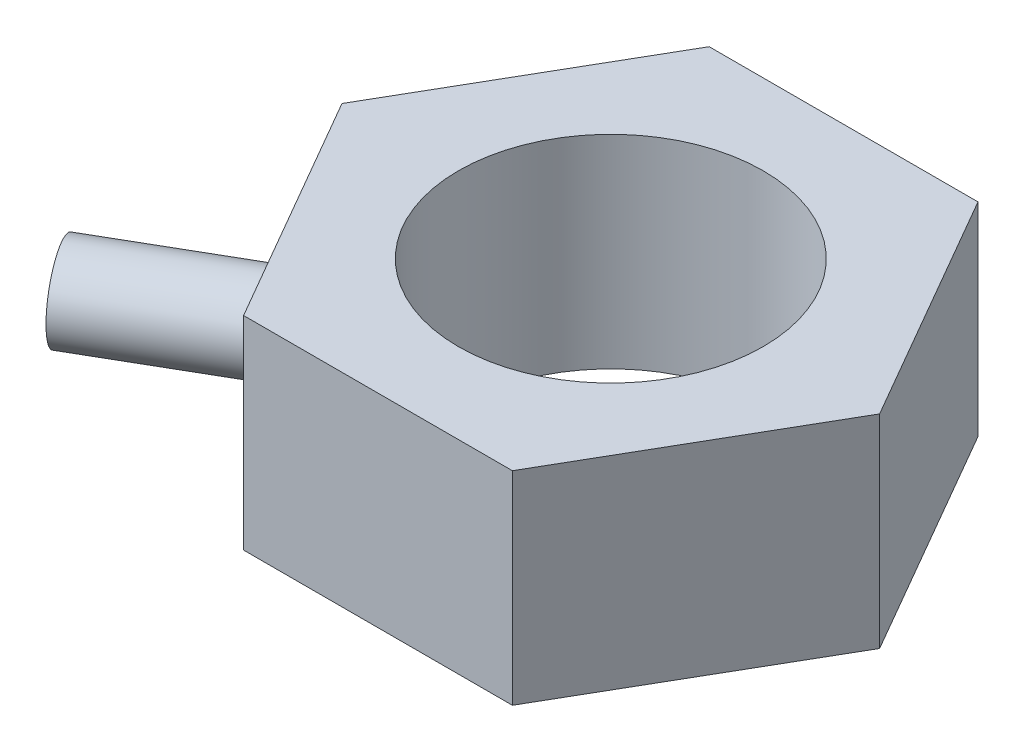
ISO-10303-21;
HEADER;
FILE_DESCRIPTION(('STEP AP214'),'2;1');
FILE_NAME('part.step','',(''),(''),'','','');
FILE_SCHEMA(('AUTOMOTIVE_DESIGN { 1 0 10303 214 1 1 1 1 }'));
ENDSEC;
DATA;
#1=APPLICATION_CONTEXT('core data for automotive mechanical design processes');
#2=APPLICATION_PROTOCOL_DEFINITION('international standard','automotive_design',2000,#1);
#3=PRODUCT_CONTEXT('',#1,'mechanical');
#4=PRODUCT('Part','Part','',(#3));
#5=PRODUCT_RELATED_PRODUCT_CATEGORY('part','',(#4));
#6=PRODUCT_DEFINITION_FORMATION('','',#4);
#7=PRODUCT_DEFINITION_CONTEXT('part definition',#1,'design');
#8=PRODUCT_DEFINITION('design','',#6,#7);
#9=PRODUCT_DEFINITION_SHAPE('','',#8);
#10=(LENGTH_UNIT() NAMED_UNIT(*) SI_UNIT(.MILLI.,.METRE.));
#11=(NAMED_UNIT(*) PLANE_ANGLE_UNIT() SI_UNIT($,.RADIAN.));
#12=(NAMED_UNIT(*) SI_UNIT($,.STERADIAN.) SOLID_ANGLE_UNIT());
#13=UNCERTAINTY_MEASURE_WITH_UNIT(LENGTH_MEASURE(1.E-05),#10,'distance_accuracy_value','');
#14=(GEOMETRIC_REPRESENTATION_CONTEXT(3) GLOBAL_UNCERTAINTY_ASSIGNED_CONTEXT((#13)) GLOBAL_UNIT_ASSIGNED_CONTEXT((#10,
#11,#12)) REPRESENTATION_CONTEXT('',''));
#15=CARTESIAN_POINT('',(0.,0.,0.));
#16=DIRECTION('',(0.,0.,1.));
#17=DIRECTION('',(1.,0.,0.));
#18=AXIS2_PLACEMENT_3D('',#15,#16,#17);
#19=CARTESIAN_POINT('',(-2.45405788986387,-6.59314032413643,6.03046084599262));
#20=DIRECTION('',(-0.866025403784438,0.,0.500000000000001));
#21=DIRECTION('',(0.500000000000001,0.,0.866025403784438));
#22=AXIS2_PLACEMENT_3D('',#19,#20,#21);
#23=PLANE('',#22);
#24=DIRECTION('',(-0.500000000000001,0.,-0.866025403784438));
#25=VECTOR('',#24,1.);
#26=CARTESIAN_POINT('',(-2.45405788986387,-8.99314032413643,6.03046084599262));
#27=LINE('',#26,#25);
#28=CARTESIAN_POINT('',(-2.45405788986387,-8.99314032413643,6.03046084599262));
#29=VERTEX_POINT('',#28);
#30=CARTESIAN_POINT('',(-4.04177113013535,-8.99314032413643,3.28046084599261));
#31=VERTEX_POINT('',#30);
#32=EDGE_CURVE('E118',#29,#31,#27,.T.);
#33=ORIENTED_EDGE('',*,*,#32,.T.);
#34=DIRECTION('',(0.,-1.,0.));
#35=VECTOR('',#34,1.);
#36=CARTESIAN_POINT('',(-4.04177113013535,-6.59314032413643,3.28046084599261));
#37=LINE('',#36,#35);
#38=CARTESIAN_POINT('',(-4.04177113013535,-6.59314032413643,3.28046084599261));
#39=VERTEX_POINT('',#38);
#40=EDGE_CURVE('E41',#39,#31,#37,.T.);
#41=ORIENTED_EDGE('',*,*,#40,.F.);
#42=DIRECTION('',(-0.500000000000001,0.,-0.866025403784438));
#43=VECTOR('',#42,1.);
#44=CARTESIAN_POINT('',(-2.45405788986387,-6.59314032413643,6.03046084599262));
#45=LINE('',#44,#43);
#46=CARTESIAN_POINT('',(-2.45405788986387,-6.59314032413643,6.03046084599262));
#47=VERTEX_POINT('',#46);
#48=EDGE_CURVE('E129',#47,#39,#45,.T.);
#49=ORIENTED_EDGE('',*,*,#48,.F.);
#50=DIRECTION('',(0.,-1.,0.));
#51=VECTOR('',#50,1.);
#52=CARTESIAN_POINT('',(-2.45405788986387,-6.59314032413643,6.03046084599262));
#53=LINE('',#52,#51);
#54=EDGE_CURVE('E114',#47,#29,#53,.T.);
#55=ORIENTED_EDGE('',*,*,#54,.T.);
#56=EDGE_LOOP('',(#33,#41,#49,#55));
#57=FACE_BOUND('',#56,.T.);
#58=ADVANCED_FACE('F33',(#57),#23,.F.);
#59=CARTESIAN_POINT('',(-4.04177113013535,-6.59314032413643,3.28046084599261));
#60=DIRECTION('',(0.,0.,1.));
#61=DIRECTION('',(1.,0.,0.));
#62=AXIS2_PLACEMENT_3D('',#59,#60,#61);
#63=PLANE('',#62);
#64=DIRECTION('',(-1.,0.,0.));
#65=VECTOR('',#64,1.);
#66=CARTESIAN_POINT('',(-4.04177113013535,-8.99314032413643,3.28046084599261));
#67=LINE('',#66,#65);
#68=CARTESIAN_POINT('',(-7.21719761067831,-8.99314032413643,3.28046084599262));
#69=VERTEX_POINT('',#68);
#70=EDGE_CURVE('E121',#31,#69,#67,.T.);
#71=ORIENTED_EDGE('',*,*,#70,.T.);
#72=DIRECTION('',(0.,-1.,0.));
#73=VECTOR('',#72,1.);
#74=CARTESIAN_POINT('',(-7.21719761067831,-6.59314032413643,3.28046084599262));
#75=LINE('',#74,#73);
#76=CARTESIAN_POINT('',(-7.21719761067831,-6.59314032413643,3.28046084599262));
#77=VERTEX_POINT('',#76);
#78=EDGE_CURVE('E133',#77,#69,#75,.T.);
#79=ORIENTED_EDGE('',*,*,#78,.F.);
#80=DIRECTION('',(-1.,0.,0.));
#81=VECTOR('',#80,1.);
#82=CARTESIAN_POINT('',(-4.04177113013535,-6.59314032413643,3.28046084599261));
#83=LINE('',#82,#81);
#84=EDGE_CURVE('E87',#39,#77,#83,.T.);
#85=ORIENTED_EDGE('',*,*,#84,.F.);
#86=ORIENTED_EDGE('',*,*,#40,.T.);
#87=EDGE_LOOP('',(#71,#79,#85,#86));
#88=FACE_BOUND('',#87,.T.);
#89=ADVANCED_FACE('F151',(#88),#63,.F.);
#90=CARTESIAN_POINT('',(-7.21719761067831,-6.59314032413643,3.28046084599262));
#91=DIRECTION('',(0.866025403784441,0.,0.499999999999995));
#92=DIRECTION('',(0.499999999999995,0.,-0.866025403784442));
#93=AXIS2_PLACEMENT_3D('',#90,#91,#92);
#94=PLANE('',#93);
#95=DIRECTION('',(-0.499999999999995,0.,0.866025403784442));
#96=VECTOR('',#95,1.);
#97=CARTESIAN_POINT('',(-7.21719761067831,-8.99314032413643,3.28046084599262));
#98=LINE('',#97,#96);
#99=CARTESIAN_POINT('',(-8.80491085094977,-8.99314032413643,6.03046084599265));
#100=VERTEX_POINT('',#99);
#101=EDGE_CURVE('E124',#69,#100,#98,.T.);
#102=ORIENTED_EDGE('',*,*,#101,.T.);
#103=DIRECTION('',(0.,-1.,0.));
#104=VECTOR('',#103,1.);
#105=CARTESIAN_POINT('',(-8.80491085094977,-6.59314032413643,6.03046084599265));
#106=LINE('',#105,#104);
#107=CARTESIAN_POINT('',(-8.80491085094977,-6.59314032413643,6.03046084599265));
#108=VERTEX_POINT('',#107);
#109=EDGE_CURVE('E109',#108,#100,#106,.T.);
#110=ORIENTED_EDGE('',*,*,#109,.F.);
#111=DIRECTION('',(-0.499999999999995,0.,0.866025403784442));
#112=VECTOR('',#111,1.);
#113=CARTESIAN_POINT('',(-7.21719761067831,-6.59314032413643,3.28046084599262));
#114=LINE('',#113,#112);
#115=EDGE_CURVE('E100',#77,#108,#114,.T.);
#116=ORIENTED_EDGE('',*,*,#115,.F.);
#117=ORIENTED_EDGE('',*,*,#78,.T.);
#118=EDGE_LOOP('',(#102,#110,#116,#117));
#119=FACE_BOUND('',#118,.T.);
#120=ADVANCED_FACE('F154',(#119),#94,.F.);
#121=CARTESIAN_POINT('',(-8.80491085094977,-6.59314032413643,6.03046084599265));
#122=DIRECTION('',(0.866025403784434,0.,-0.500000000000007));
#123=DIRECTION('',(-0.500000000000007,0.,-0.866025403784435));
#124=AXIS2_PLACEMENT_3D('',#121,#122,#123);
#125=PLANE('',#124);
#126=CARTESIAN_POINT('',(-8.01105423081402,-7.79314032413643,7.40546084599264));
#127=DIRECTION('',(0.866025403784434,0.,-0.500000000000007));
#128=DIRECTION('',(-0.500000000000007,0.,-0.866025403784435));
#129=AXIS2_PLACEMENT_3D('',#126,#127,#128);
#130=CIRCLE('',#129,0.5);
#131=CARTESIAN_POINT('',(-8.26105423081403,-7.79314032413643,6.97244814410043));
#132=VERTEX_POINT('',#131);
#133=EDGE_CURVE('E11',#132,#132,#130,.F.);
#134=ORIENTED_EDGE('',*,*,#133,.F.);
#135=EDGE_LOOP('',(#134));
#136=FACE_BOUND('',#135,.T.);
#137=DIRECTION('',(0.500000000000007,0.,0.866025403784435));
#138=VECTOR('',#137,1.);
#139=CARTESIAN_POINT('',(-8.80491085094977,-8.99314032413643,6.03046084599265));
#140=LINE('',#139,#138);
#141=CARTESIAN_POINT('',(-7.21719761067827,-8.99314032413643,8.78046084599265));
#142=VERTEX_POINT('',#141);
#143=EDGE_CURVE('E108',#100,#142,#140,.T.);
#144=ORIENTED_EDGE('',*,*,#143,.T.);
#145=DIRECTION('',(0.,-1.,0.));
#146=VECTOR('',#145,1.);
#147=CARTESIAN_POINT('',(-7.21719761067827,-6.59314032413643,8.78046084599265));
#148=LINE('',#147,#146);
#149=CARTESIAN_POINT('',(-7.21719761067827,-6.59314032413643,8.78046084599265));
#150=VERTEX_POINT('',#149);
#151=EDGE_CURVE('E105',#150,#142,#148,.T.);
#152=ORIENTED_EDGE('',*,*,#151,.F.);
#153=DIRECTION('',(0.500000000000007,0.,0.866025403784435));
#154=VECTOR('',#153,1.);
#155=CARTESIAN_POINT('',(-8.80491085094977,-6.59314032413643,6.03046084599265));
#156=LINE('',#155,#154);
#157=EDGE_CURVE('E94',#108,#150,#156,.T.);
#158=ORIENTED_EDGE('',*,*,#157,.F.);
#159=ORIENTED_EDGE('',*,*,#109,.T.);
#160=EDGE_LOOP('',(#144,#152,#158,#159));
#161=FACE_BOUND('',#160,.T.);
#162=ADVANCED_FACE('F106',(#136,#161),#125,.F.);
#163=CARTESIAN_POINT('',(-7.21719761067827,-6.59314032413643,8.78046084599265));
#164=DIRECTION('',(0.,0.,-1.));
#165=DIRECTION('',(-1.,0.,0.));
#166=AXIS2_PLACEMENT_3D('',#163,#164,#165);
#167=PLANE('',#166);
#168=DIRECTION('',(1.,0.,0.));
#169=VECTOR('',#168,1.);
#170=CARTESIAN_POINT('',(-7.21719761067827,-8.99314032413643,8.78046084599265));
#171=LINE('',#170,#169);
#172=CARTESIAN_POINT('',(-4.04177113013531,-8.99314032413643,8.78046084599261));
#173=VERTEX_POINT('',#172);
#174=EDGE_CURVE('E72',#142,#173,#171,.T.);
#175=ORIENTED_EDGE('',*,*,#174,.T.);
#176=DIRECTION('',(0.,-1.,0.));
#177=VECTOR('',#176,1.);
#178=CARTESIAN_POINT('',(-4.04177113013531,-6.59314032413643,8.78046084599261));
#179=LINE('',#178,#177);
#180=CARTESIAN_POINT('',(-4.04177113013531,-6.59314032413643,8.78046084599261));
#181=VERTEX_POINT('',#180);
#182=EDGE_CURVE('E110',#181,#173,#179,.T.);
#183=ORIENTED_EDGE('',*,*,#182,.F.);
#184=DIRECTION('',(1.,0.,0.));
#185=VECTOR('',#184,1.);
#186=CARTESIAN_POINT('',(-7.21719761067827,-6.59314032413643,8.78046084599265));
#187=LINE('',#186,#185);
#188=EDGE_CURVE('E98',#150,#181,#187,.T.);
#189=ORIENTED_EDGE('',*,*,#188,.F.);
#190=ORIENTED_EDGE('',*,*,#151,.T.);
#191=EDGE_LOOP('',(#175,#183,#189,#190));
#192=FACE_BOUND('',#191,.T.);
#193=ADVANCED_FACE('F112',(#192),#167,.F.);
#194=CARTESIAN_POINT('',(-4.04177113013531,-6.59314032413643,8.78046084599261));
#195=DIRECTION('',(-0.866025403784441,0.,-0.499999999999995));
#196=DIRECTION('',(-0.499999999999995,0.,0.866025403784442));
#197=AXIS2_PLACEMENT_3D('',#194,#195,#196);
#198=PLANE('',#197);
#199=DIRECTION('',(0.499999999999995,0.,-0.866025403784442));
#200=VECTOR('',#199,1.);
#201=CARTESIAN_POINT('',(-4.04177113013531,-8.99314032413643,8.78046084599261));
#202=LINE('',#201,#200);
#203=EDGE_CURVE('E78',#173,#29,#202,.T.);
#204=ORIENTED_EDGE('',*,*,#203,.T.);
#205=ORIENTED_EDGE('',*,*,#54,.F.);
#206=DIRECTION('',(0.499999999999995,0.,-0.866025403784442));
#207=VECTOR('',#206,1.);
#208=CARTESIAN_POINT('',(-4.04177113013531,-6.59314032413643,8.78046084599261));
#209=LINE('',#208,#207);
#210=EDGE_CURVE('E49',#181,#47,#209,.T.);
#211=ORIENTED_EDGE('',*,*,#210,.F.);
#212=ORIENTED_EDGE('',*,*,#182,.T.);
#213=EDGE_LOOP('',(#204,#205,#211,#212));
#214=FACE_BOUND('',#213,.T.);
#215=ADVANCED_FACE('F159',(#214),#198,.F.);
#216=CARTESIAN_POINT('',(-5.62948437040682,-6.59314032413643,6.03046084599262));
#217=DIRECTION('',(0.,1.,0.));
#218=DIRECTION('',(0.,0.,1.));
#219=AXIS2_PLACEMENT_3D('',#216,#217,#218);
#220=PLANE('',#219);
#221=CARTESIAN_POINT('',(-5.62948437040682,-6.59314032413643,6.03046084599262));
#222=DIRECTION('',(0.,1.,0.));
#223=DIRECTION('',(0.,0.,1.));
#224=AXIS2_PLACEMENT_3D('',#221,#222,#223);
#225=CIRCLE('',#224,1.8);
#226=CARTESIAN_POINT('',(-5.62948437040682,-6.59314032413643,7.83046084599262));
#227=VERTEX_POINT('',#226);
#228=EDGE_CURVE('E122',#227,#227,#225,.T.);
#229=ORIENTED_EDGE('',*,*,#228,.F.);
#230=EDGE_LOOP('',(#229));
#231=FACE_BOUND('',#230,.T.);
#232=ORIENTED_EDGE('',*,*,#48,.T.);
#233=ORIENTED_EDGE('',*,*,#84,.T.);
#234=ORIENTED_EDGE('',*,*,#115,.T.);
#235=ORIENTED_EDGE('',*,*,#157,.T.);
#236=ORIENTED_EDGE('',*,*,#188,.T.);
#237=ORIENTED_EDGE('',*,*,#210,.T.);
#238=EDGE_LOOP('',(#232,#233,#234,#235,#236,#237));
#239=FACE_BOUND('',#238,.T.);
#240=ADVANCED_FACE('F96',(#231,#239),#220,.T.);
#241=CARTESIAN_POINT('',(-5.62948437040682,-8.99314032413643,6.03046084599262));
#242=DIRECTION('',(0.,1.,0.));
#243=DIRECTION('',(0.,0.,1.));
#244=AXIS2_PLACEMENT_3D('',#241,#242,#243);
#245=PLANE('',#244);
#246=CARTESIAN_POINT('',(-5.62948437040682,-8.99314032413643,6.03046084599262));
#247=DIRECTION('',(0.,1.,0.));
#248=DIRECTION('',(0.,0.,1.));
#249=AXIS2_PLACEMENT_3D('',#246,#247,#248);
#250=CIRCLE('',#249,1.8);
#251=CARTESIAN_POINT('',(-5.62948437040682,-8.99314032413643,7.83046084599262));
#252=VERTEX_POINT('',#251);
#253=EDGE_CURVE('E136',#252,#252,#250,.T.);
#254=ORIENTED_EDGE('',*,*,#253,.T.);
#255=EDGE_LOOP('',(#254));
#256=FACE_BOUND('',#255,.T.);
#257=ORIENTED_EDGE('',*,*,#32,.F.);
#258=ORIENTED_EDGE('',*,*,#203,.F.);
#259=ORIENTED_EDGE('',*,*,#174,.F.);
#260=ORIENTED_EDGE('',*,*,#143,.F.);
#261=ORIENTED_EDGE('',*,*,#101,.F.);
#262=ORIENTED_EDGE('',*,*,#70,.F.);
#263=EDGE_LOOP('',(#257,#258,#259,#260,#261,#262));
#264=FACE_BOUND('',#263,.T.);
#265=ADVANCED_FACE('F157',(#256,#264),#245,.F.);
#266=CARTESIAN_POINT('',(-5.62948437040682,-56.5931403241364,6.03046084599262));
#267=DIRECTION('',(0.,1.,0.));
#268=DIRECTION('',(0.,0.,1.));
#269=AXIS2_PLACEMENT_3D('',#266,#267,#268);
#270=CYLINDRICAL_SURFACE('',#269,1.8);
#271=ORIENTED_EDGE('',*,*,#228,.T.);
#272=EDGE_LOOP('',(#271));
#273=FACE_BOUND('',#272,.T.);
#274=ORIENTED_EDGE('',*,*,#253,.F.);
#275=EDGE_LOOP('',(#274));
#276=FACE_BOUND('',#275,.T.);
#277=ADVANCED_FACE('F189',(#273,#276),#270,.F.);
#278=CARTESIAN_POINT('',(-8.87707963459846,-7.79314032413643,7.90546084599265));
#279=DIRECTION('',(0.866025403784435,0.,-0.500000000000007));
#280=DIRECTION('',(-0.500000000000007,0.,-0.866025403784434));
#281=AXIS2_PLACEMENT_3D('',#278,#279,#280);
#282=CYLINDRICAL_SURFACE('',#281,0.5);
#283=ORIENTED_EDGE('',*,*,#133,.T.);
#284=EDGE_LOOP('',(#283));
#285=FACE_BOUND('',#284,.T.);
#286=CARTESIAN_POINT('',(-9.74310503838289,-7.79314032413643,8.40546084599266));
#287=DIRECTION('',(-0.866025403784434,0.,0.500000000000007));
#288=DIRECTION('',(0.500000000000007,0.,0.866025403784435));
#289=AXIS2_PLACEMENT_3D('',#286,#287,#288);
#290=CIRCLE('',#289,0.5);
#291=CARTESIAN_POINT('',(-9.49310503838289,-7.79314032413643,8.83847354788488));
#292=VERTEX_POINT('',#291);
#293=EDGE_CURVE('E138',#292,#292,#290,.T.);
#294=ORIENTED_EDGE('',*,*,#293,.F.);
#295=EDGE_LOOP('',(#294));
#296=FACE_BOUND('',#295,.T.);
#297=ADVANCED_FACE('F185',(#285,#296),#282,.T.);
#298=CARTESIAN_POINT('',(-9.74310503838289,-7.79314032413643,8.40546084599266));
#299=DIRECTION('',(-0.866025403784434,0.,0.500000000000007));
#300=DIRECTION('',(0.500000000000007,0.,0.866025403784435));
#301=AXIS2_PLACEMENT_3D('',#298,#299,#300);
#302=PLANE('',#301);
#303=ORIENTED_EDGE('',*,*,#293,.T.);
#304=EDGE_LOOP('',(#303));
#305=FACE_BOUND('',#304,.T.);
#306=ADVANCED_FACE('F188',(#305),#302,.T.);
#307=CLOSED_SHELL('',(#58,#89,#120,#162,#193,#215,#240,#265,#277,#297,#306));
#308=MANIFOLD_SOLID_BREP('B2',#307);
#309=ADVANCED_BREP_SHAPE_REPRESENTATION('',(#18,#308),#14);
#310=SHAPE_DEFINITION_REPRESENTATION(#9,#309);
ENDSEC;
END-ISO-10303-21;
